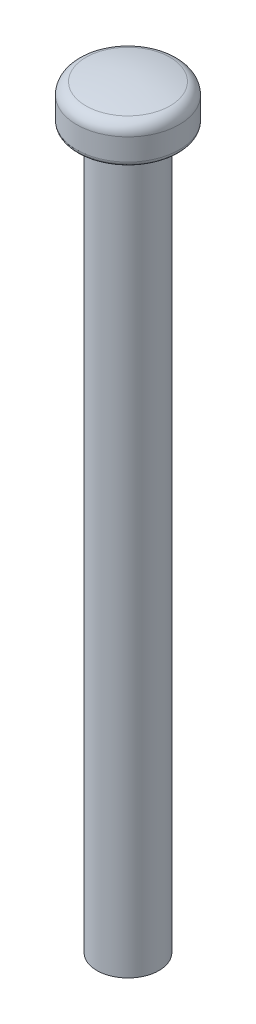
ISO-10303-21;
HEADER;
FILE_DESCRIPTION(('STEP AP214'),'2;1');
FILE_NAME('part.step','',(''),(''),'','','');
FILE_SCHEMA(('AUTOMOTIVE_DESIGN { 1 0 10303 214 1 1 1 1 }'));
ENDSEC;
DATA;
#1=APPLICATION_CONTEXT('core data for automotive mechanical design processes');
#2=APPLICATION_PROTOCOL_DEFINITION('international standard','automotive_design',2000,#1);
#3=PRODUCT_CONTEXT('',#1,'mechanical');
#4=PRODUCT('Part','Part','',(#3));
#5=PRODUCT_RELATED_PRODUCT_CATEGORY('part','',(#4));
#6=PRODUCT_DEFINITION_FORMATION('','',#4);
#7=PRODUCT_DEFINITION_CONTEXT('part definition',#1,'design');
#8=PRODUCT_DEFINITION('design','',#6,#7);
#9=PRODUCT_DEFINITION_SHAPE('','',#8);
#10=(LENGTH_UNIT() NAMED_UNIT(*) SI_UNIT(.MILLI.,.METRE.));
#11=(NAMED_UNIT(*) PLANE_ANGLE_UNIT() SI_UNIT($,.RADIAN.));
#12=(NAMED_UNIT(*) SI_UNIT($,.STERADIAN.) SOLID_ANGLE_UNIT());
#13=UNCERTAINTY_MEASURE_WITH_UNIT(LENGTH_MEASURE(1.E-05),#10,'distance_accuracy_value','');
#14=(GEOMETRIC_REPRESENTATION_CONTEXT(3) GLOBAL_UNCERTAINTY_ASSIGNED_CONTEXT((#13)) GLOBAL_UNIT_ASSIGNED_CONTEXT((#10,
#11,#12)) REPRESENTATION_CONTEXT('',''));
#15=CARTESIAN_POINT('',(0.,0.,0.));
#16=DIRECTION('',(0.,0.,1.));
#17=DIRECTION('',(1.,0.,0.));
#18=AXIS2_PLACEMENT_3D('',#15,#16,#17);
#19=CARTESIAN_POINT('',(0.,-6.05416666666667,0.));
#20=DIRECTION('',(1.,0.,0.));
#21=DIRECTION('',(0.,-1.,0.));
#22=AXIS2_PLACEMENT_3D('',#19,#20,#21);
#23=SPHERICAL_SURFACE('',#22,7.85416666666667);
#24=CARTESIAN_POINT('',(0.,1.59976376695537,0.));
#25=DIRECTION('',(0.,-1.,0.));
#26=DIRECTION('',(1.,0.,0.));
#27=AXIS2_PLACEMENT_3D('',#24,#25,#26);
#28=CIRCLE('',#27,1.76218130311615);
#29=CARTESIAN_POINT('',(1.76218130311615,1.59976376695537,0.));
#30=VERTEX_POINT('',#29);
#31=EDGE_CURVE('E115',#30,#30,#28,.T.);
#32=ORIENTED_EDGE('',*,*,#31,.F.);
#33=EDGE_LOOP('',(#32));
#34=FACE_BOUND('',#33,.T.);
#35=ADVANCED_FACE('F17',(#34),#23,.T.);
#36=CARTESIAN_POINT('',(0.,1.1125109011545,0.));
#37=DIRECTION('',(0.,-1.,0.));
#38=DIRECTION('',(1.,0.,0.));
#39=AXIS2_PLACEMENT_3D('',#36,#37,#38);
#40=TOROIDAL_SURFACE('',#39,1.65,0.5);
#41=ORIENTED_EDGE('',*,*,#31,.T.);
#42=EDGE_LOOP('',(#41));
#43=FACE_BOUND('',#42,.T.);
#44=CARTESIAN_POINT('',(0.,1.1125109011545,0.));
#45=DIRECTION('',(0.,1.,0.));
#46=DIRECTION('',(-1.,0.,0.));
#47=AXIS2_PLACEMENT_3D('',#44,#45,#46);
#48=CIRCLE('',#47,2.15);
#49=CARTESIAN_POINT('',(-2.15,1.1125109011545,0.));
#50=VERTEX_POINT('',#49);
#51=EDGE_CURVE('E89',#50,#50,#48,.F.);
#52=ORIENTED_EDGE('',*,*,#51,.F.);
#53=EDGE_LOOP('',(#52));
#54=FACE_BOUND('',#53,.T.);
#55=ADVANCED_FACE('F92',(#43,#54),#40,.T.);
#56=CARTESIAN_POINT('',(0.,1.8,0.));
#57=DIRECTION('',(0.,1.,0.));
#58=DIRECTION('',(-1.,0.,0.));
#59=AXIS2_PLACEMENT_3D('',#56,#57,#58);
#60=CYLINDRICAL_SURFACE('',#59,2.15);
#61=CARTESIAN_POINT('',(0.,0.2,0.));
#62=DIRECTION('',(0.,1.,0.));
#63=DIRECTION('',(-1.,0.,0.));
#64=AXIS2_PLACEMENT_3D('',#61,#62,#63);
#65=CIRCLE('',#64,2.15);
#66=CARTESIAN_POINT('',(-2.15,0.2,0.));
#67=VERTEX_POINT('',#66);
#68=EDGE_CURVE('E47',#67,#67,#65,.F.);
#69=ORIENTED_EDGE('',*,*,#68,.F.);
#70=EDGE_LOOP('',(#69));
#71=FACE_BOUND('',#70,.T.);
#72=ORIENTED_EDGE('',*,*,#51,.T.);
#73=EDGE_LOOP('',(#72));
#74=FACE_BOUND('',#73,.T.);
#75=ADVANCED_FACE('F77',(#71,#74),#60,.T.);
#76=CARTESIAN_POINT('',(0.,0.2,0.));
#77=DIRECTION('',(0.,1.,0.));
#78=DIRECTION('',(-1.,0.,0.));
#79=AXIS2_PLACEMENT_3D('',#76,#77,#78);
#80=TOROIDAL_SURFACE('',#79,1.95,0.2);
#81=CARTESIAN_POINT('',(0.,0.,0.));
#82=DIRECTION('',(0.,1.,0.));
#83=DIRECTION('',(-1.,0.,0.));
#84=AXIS2_PLACEMENT_3D('',#81,#82,#83);
#85=CIRCLE('',#84,1.95);
#86=CARTESIAN_POINT('',(-1.95,0.,0.));
#87=VERTEX_POINT('',#86);
#88=CARTESIAN_POINT('',(1.95,0.,0.));
#89=VERTEX_POINT('',#88);
#90=EDGE_CURVE('E35',#87,#89,#85,.T.);
#91=ORIENTED_EDGE('',*,*,#90,.T.);
#92=CARTESIAN_POINT('',(0.,0.,0.));
#93=DIRECTION('',(0.,1.,0.));
#94=DIRECTION('',(1.,0.,0.));
#95=AXIS2_PLACEMENT_3D('',#92,#93,#94);
#96=CIRCLE('',#95,1.95);
#97=EDGE_CURVE('E37',#89,#87,#96,.T.);
#98=ORIENTED_EDGE('',*,*,#97,.T.);
#99=EDGE_LOOP('',(#91,#98));
#100=FACE_BOUND('',#99,.T.);
#101=ORIENTED_EDGE('',*,*,#68,.T.);
#102=EDGE_LOOP('',(#101));
#103=FACE_BOUND('',#102,.T.);
#104=ADVANCED_FACE('F39',(#100,#103),#80,.T.);
#105=CARTESIAN_POINT('',(0.,-30.,0.));
#106=DIRECTION('',(0.,-1.,0.));
#107=DIRECTION('',(0.,0.,-1.));
#108=AXIS2_PLACEMENT_3D('',#105,#106,#107);
#109=PLANE('',#108);
#110=CARTESIAN_POINT('',(0.,-30.,0.));
#111=DIRECTION('',(0.,1.,0.));
#112=DIRECTION('',(0.,0.,1.));
#113=AXIS2_PLACEMENT_3D('',#110,#111,#112);
#114=CIRCLE('',#113,1.3);
#115=CARTESIAN_POINT('',(0.,-30.,1.3));
#116=VERTEX_POINT('',#115);
#117=EDGE_CURVE('E28',#116,#116,#114,.T.);
#118=ORIENTED_EDGE('',*,*,#117,.F.);
#119=EDGE_LOOP('',(#118));
#120=FACE_BOUND('',#119,.T.);
#121=ADVANCED_FACE('F63',(#120),#109,.T.);
#122=CARTESIAN_POINT('',(0.,0.,0.));
#123=DIRECTION('',(0.,1.,0.));
#124=DIRECTION('',(-1.,0.,0.));
#125=AXIS2_PLACEMENT_3D('',#122,#123,#124);
#126=PLANE('',#125);
#127=CARTESIAN_POINT('',(0.,0.,0.));
#128=DIRECTION('',(0.,1.,0.));
#129=DIRECTION('',(0.,0.,1.));
#130=AXIS2_PLACEMENT_3D('',#127,#128,#129);
#131=CIRCLE('',#130,1.3);
#132=CARTESIAN_POINT('',(0.,0.,1.3));
#133=VERTEX_POINT('',#132);
#134=EDGE_CURVE('E11',#133,#133,#131,.F.);
#135=ORIENTED_EDGE('',*,*,#134,.F.);
#136=EDGE_LOOP('',(#135));
#137=FACE_BOUND('',#136,.T.);
#138=ORIENTED_EDGE('',*,*,#90,.F.);
#139=ORIENTED_EDGE('',*,*,#97,.F.);
#140=EDGE_LOOP('',(#138,#139));
#141=FACE_BOUND('',#140,.T.);
#142=ADVANCED_FACE('F46',(#137,#141),#126,.F.);
#143=CARTESIAN_POINT('',(0.,-30.,0.));
#144=DIRECTION('',(0.,1.,0.));
#145=DIRECTION('',(0.,0.,1.));
#146=AXIS2_PLACEMENT_3D('',#143,#144,#145);
#147=CYLINDRICAL_SURFACE('',#146,1.3);
#148=ORIENTED_EDGE('',*,*,#134,.T.);
#149=EDGE_LOOP('',(#148));
#150=FACE_BOUND('',#149,.T.);
#151=ORIENTED_EDGE('',*,*,#117,.T.);
#152=EDGE_LOOP('',(#151));
#153=FACE_BOUND('',#152,.T.);
#154=ADVANCED_FACE('F62',(#150,#153),#147,.T.);
#155=CLOSED_SHELL('',(#35,#55,#75,#104,#121,#142,#154));
#156=MANIFOLD_SOLID_BREP('B1',#155);
#157=ADVANCED_BREP_SHAPE_REPRESENTATION('',(#18,#156),#14);
#158=SHAPE_DEFINITION_REPRESENTATION(#9,#157);
ENDSEC;
END-ISO-10303-21;
